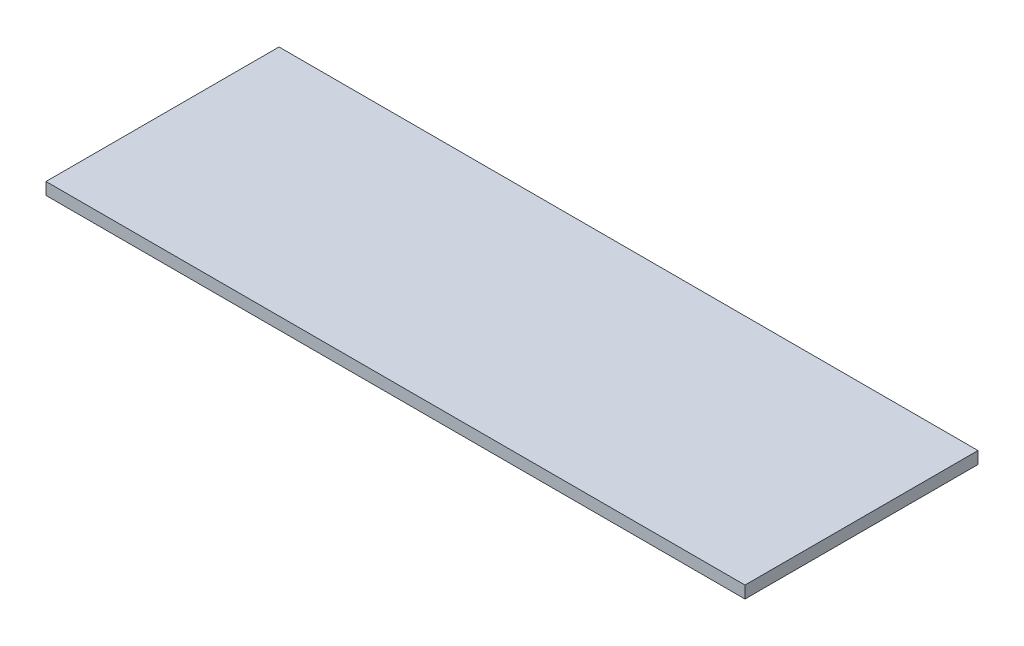
ISO-10303-21;
HEADER;
FILE_DESCRIPTION(('STEP AP214'),'2;1');
FILE_NAME('part.step','',(''),(''),'','','');
FILE_SCHEMA(('AUTOMOTIVE_DESIGN { 1 0 10303 214 1 1 1 1 }'));
ENDSEC;
DATA;
#1=APPLICATION_CONTEXT('core data for automotive mechanical design processes');
#2=APPLICATION_PROTOCOL_DEFINITION('international standard','automotive_design',2000,#1);
#3=PRODUCT_CONTEXT('',#1,'mechanical');
#4=PRODUCT('Part','Part','',(#3));
#5=PRODUCT_RELATED_PRODUCT_CATEGORY('part','',(#4));
#6=PRODUCT_DEFINITION_FORMATION('','',#4);
#7=PRODUCT_DEFINITION_CONTEXT('part definition',#1,'design');
#8=PRODUCT_DEFINITION('design','',#6,#7);
#9=PRODUCT_DEFINITION_SHAPE('','',#8);
#10=(LENGTH_UNIT() NAMED_UNIT(*) SI_UNIT(.MILLI.,.METRE.));
#11=(NAMED_UNIT(*) PLANE_ANGLE_UNIT() SI_UNIT($,.RADIAN.));
#12=(NAMED_UNIT(*) SI_UNIT($,.STERADIAN.) SOLID_ANGLE_UNIT());
#13=UNCERTAINTY_MEASURE_WITH_UNIT(LENGTH_MEASURE(1.E-05),#10,'distance_accuracy_value','');
#14=(GEOMETRIC_REPRESENTATION_CONTEXT(3) GLOBAL_UNCERTAINTY_ASSIGNED_CONTEXT((#13)) GLOBAL_UNIT_ASSIGNED_CONTEXT((#10,
#11,#12)) REPRESENTATION_CONTEXT('',''));
#15=CARTESIAN_POINT('',(0.,0.,0.));
#16=DIRECTION('',(0.,0.,1.));
#17=DIRECTION('',(1.,0.,0.));
#18=AXIS2_PLACEMENT_3D('',#15,#16,#17);
#19=CARTESIAN_POINT('',(914.400000000001,31.75,304.8));
#20=DIRECTION('',(-1.,0.,0.));
#21=DIRECTION('',(0.,0.,1.));
#22=AXIS2_PLACEMENT_3D('',#19,#20,#21);
#23=PLANE('',#22);
#24=DIRECTION('',(0.,0.,-1.));
#25=VECTOR('',#24,1.);
#26=CARTESIAN_POINT('',(914.400000000001,0.,304.8));
#27=LINE('',#26,#25);
#28=CARTESIAN_POINT('',(914.400000000001,0.,304.8));
#29=VERTEX_POINT('',#28);
#30=CARTESIAN_POINT('',(914.400000000001,0.,-304.8));
#31=VERTEX_POINT('',#30);
#32=EDGE_CURVE('E104',#29,#31,#27,.T.);
#33=ORIENTED_EDGE('',*,*,#32,.T.);
#34=DIRECTION('',(0.,-1.,0.));
#35=VECTOR('',#34,1.);
#36=CARTESIAN_POINT('',(914.400000000001,31.75,-304.8));
#37=LINE('',#36,#35);
#38=CARTESIAN_POINT('',(914.400000000001,31.75,-304.8));
#39=VERTEX_POINT('',#38);
#40=EDGE_CURVE('E11',#39,#31,#37,.T.);
#41=ORIENTED_EDGE('',*,*,#40,.F.);
#42=DIRECTION('',(0.,0.,-1.));
#43=VECTOR('',#42,1.);
#44=CARTESIAN_POINT('',(914.400000000001,31.75,304.8));
#45=LINE('',#44,#43);
#46=CARTESIAN_POINT('',(914.400000000001,31.75,304.8));
#47=VERTEX_POINT('',#46);
#48=EDGE_CURVE('E92',#47,#39,#45,.T.);
#49=ORIENTED_EDGE('',*,*,#48,.F.);
#50=DIRECTION('',(0.,-1.,0.));
#51=VECTOR('',#50,1.);
#52=CARTESIAN_POINT('',(914.400000000001,31.75,304.8));
#53=LINE('',#52,#51);
#54=EDGE_CURVE('E100',#47,#29,#53,.T.);
#55=ORIENTED_EDGE('',*,*,#54,.T.);
#56=EDGE_LOOP('',(#33,#41,#49,#55));
#57=FACE_BOUND('',#56,.T.);
#58=ADVANCED_FACE('F41',(#57),#23,.F.);
#59=CARTESIAN_POINT('',(-914.399999999999,31.75,-304.8));
#60=DIRECTION('',(0.,0.,1.));
#61=DIRECTION('',(1.,0.,0.));
#62=AXIS2_PLACEMENT_3D('',#59,#60,#61);
#63=PLANE('',#62);
#64=DIRECTION('',(-1.,0.,0.));
#65=VECTOR('',#64,1.);
#66=CARTESIAN_POINT('',(-914.399999999999,0.,-304.8));
#67=LINE('',#66,#65);
#68=CARTESIAN_POINT('',(-914.399999999999,0.,-304.8));
#69=VERTEX_POINT('',#68);
#70=EDGE_CURVE('E96',#31,#69,#67,.T.);
#71=ORIENTED_EDGE('',*,*,#70,.T.);
#72=DIRECTION('',(0.,-1.,0.));
#73=VECTOR('',#72,1.);
#74=CARTESIAN_POINT('',(-914.399999999999,31.75,-304.8));
#75=LINE('',#74,#73);
#76=CARTESIAN_POINT('',(-914.399999999999,31.75,-304.8));
#77=VERTEX_POINT('',#76);
#78=EDGE_CURVE('E49',#77,#69,#75,.T.);
#79=ORIENTED_EDGE('',*,*,#78,.F.);
#80=DIRECTION('',(-1.,0.,0.));
#81=VECTOR('',#80,1.);
#82=CARTESIAN_POINT('',(-914.399999999999,31.75,-304.8));
#83=LINE('',#82,#81);
#84=EDGE_CURVE('E87',#39,#77,#83,.T.);
#85=ORIENTED_EDGE('',*,*,#84,.F.);
#86=ORIENTED_EDGE('',*,*,#40,.T.);
#87=EDGE_LOOP('',(#71,#79,#85,#86));
#88=FACE_BOUND('',#87,.T.);
#89=ADVANCED_FACE('F95',(#88),#63,.F.);
#90=CARTESIAN_POINT('',(-914.399999999999,31.75,304.8));
#91=DIRECTION('',(1.,0.,0.));
#92=DIRECTION('',(0.,0.,-1.));
#93=AXIS2_PLACEMENT_3D('',#90,#91,#92);
#94=PLANE('',#93);
#95=DIRECTION('',(0.,0.,1.));
#96=VECTOR('',#95,1.);
#97=CARTESIAN_POINT('',(-914.399999999999,0.,304.8));
#98=LINE('',#97,#96);
#99=CARTESIAN_POINT('',(-914.399999999999,0.,304.8));
#100=VERTEX_POINT('',#99);
#101=EDGE_CURVE('E74',#69,#100,#98,.T.);
#102=ORIENTED_EDGE('',*,*,#101,.T.);
#103=DIRECTION('',(0.,-1.,0.));
#104=VECTOR('',#103,1.);
#105=CARTESIAN_POINT('',(-914.399999999999,31.75,304.8));
#106=LINE('',#105,#104);
#107=CARTESIAN_POINT('',(-914.399999999999,31.75,304.8));
#108=VERTEX_POINT('',#107);
#109=EDGE_CURVE('E97',#108,#100,#106,.T.);
#110=ORIENTED_EDGE('',*,*,#109,.F.);
#111=DIRECTION('',(0.,0.,1.));
#112=VECTOR('',#111,1.);
#113=CARTESIAN_POINT('',(-914.399999999999,31.75,304.8));
#114=LINE('',#113,#112);
#115=EDGE_CURVE('E90',#77,#108,#114,.T.);
#116=ORIENTED_EDGE('',*,*,#115,.F.);
#117=ORIENTED_EDGE('',*,*,#78,.T.);
#118=EDGE_LOOP('',(#102,#110,#116,#117));
#119=FACE_BOUND('',#118,.T.);
#120=ADVANCED_FACE('F98',(#119),#94,.F.);
#121=CARTESIAN_POINT('',(-914.399999999999,31.75,304.8));
#122=DIRECTION('',(0.,0.,-1.));
#123=DIRECTION('',(-1.,0.,0.));
#124=AXIS2_PLACEMENT_3D('',#121,#122,#123);
#125=PLANE('',#124);
#126=DIRECTION('',(1.,0.,0.));
#127=VECTOR('',#126,1.);
#128=CARTESIAN_POINT('',(-914.399999999999,0.,304.8));
#129=LINE('',#128,#127);
#130=EDGE_CURVE('E80',#100,#29,#129,.T.);
#131=ORIENTED_EDGE('',*,*,#130,.T.);
#132=ORIENTED_EDGE('',*,*,#54,.F.);
#133=DIRECTION('',(1.,0.,0.));
#134=VECTOR('',#133,1.);
#135=CARTESIAN_POINT('',(-914.399999999999,31.75,304.8));
#136=LINE('',#135,#134);
#137=EDGE_CURVE('E57',#108,#47,#136,.T.);
#138=ORIENTED_EDGE('',*,*,#137,.F.);
#139=ORIENTED_EDGE('',*,*,#109,.T.);
#140=EDGE_LOOP('',(#131,#132,#138,#139));
#141=FACE_BOUND('',#140,.T.);
#142=ADVANCED_FACE('F111',(#141),#125,.F.);
#143=CARTESIAN_POINT('',(0.,31.75,0.));
#144=DIRECTION('',(0.,-1.,0.));
#145=DIRECTION('',(0.,0.,-1.));
#146=AXIS2_PLACEMENT_3D('',#143,#144,#145);
#147=PLANE('',#146);
#148=ORIENTED_EDGE('',*,*,#48,.T.);
#149=ORIENTED_EDGE('',*,*,#84,.T.);
#150=ORIENTED_EDGE('',*,*,#115,.T.);
#151=ORIENTED_EDGE('',*,*,#137,.T.);
#152=EDGE_LOOP('',(#148,#149,#150,#151));
#153=FACE_BOUND('',#152,.T.);
#154=ADVANCED_FACE('F88',(#153),#147,.F.);
#155=CARTESIAN_POINT('',(0.,0.,0.));
#156=DIRECTION('',(0.,-1.,0.));
#157=DIRECTION('',(0.,0.,-1.));
#158=AXIS2_PLACEMENT_3D('',#155,#156,#157);
#159=PLANE('',#158);
#160=ORIENTED_EDGE('',*,*,#32,.F.);
#161=ORIENTED_EDGE('',*,*,#130,.F.);
#162=ORIENTED_EDGE('',*,*,#101,.F.);
#163=ORIENTED_EDGE('',*,*,#70,.F.);
#164=EDGE_LOOP('',(#160,#161,#162,#163));
#165=FACE_BOUND('',#164,.T.);
#166=ADVANCED_FACE('F114',(#165),#159,.T.);
#167=CLOSED_SHELL('',(#58,#89,#120,#142,#154,#166));
#168=MANIFOLD_SOLID_BREP('B2',#167);
#169=ADVANCED_BREP_SHAPE_REPRESENTATION('',(#18,#168),#14);
#170=SHAPE_DEFINITION_REPRESENTATION(#9,#169);
ENDSEC;
END-ISO-10303-21;
